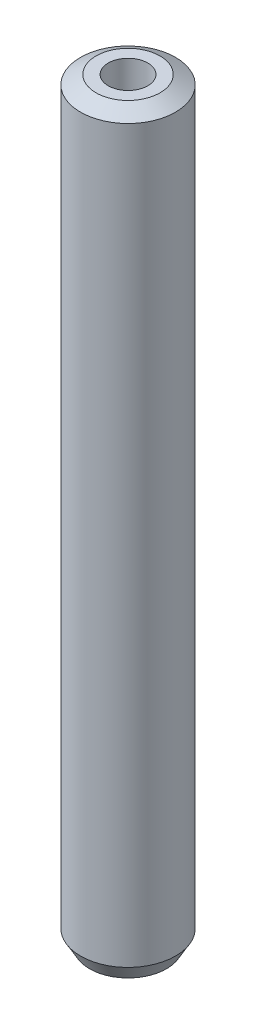
ISO-10303-21;
HEADER;
FILE_DESCRIPTION(('STEP AP214'),'2;1');
FILE_NAME('part.step','',(''),(''),'','','');
FILE_SCHEMA(('AUTOMOTIVE_DESIGN { 1 0 10303 214 1 1 1 1 }'));
ENDSEC;
DATA;
#1=APPLICATION_CONTEXT('core data for automotive mechanical design processes');
#2=APPLICATION_PROTOCOL_DEFINITION('international standard','automotive_design',2000,#1);
#3=PRODUCT_CONTEXT('',#1,'mechanical');
#4=PRODUCT('Part','Part','',(#3));
#5=PRODUCT_RELATED_PRODUCT_CATEGORY('part','',(#4));
#6=PRODUCT_DEFINITION_FORMATION('','',#4);
#7=PRODUCT_DEFINITION_CONTEXT('part definition',#1,'design');
#8=PRODUCT_DEFINITION('design','',#6,#7);
#9=PRODUCT_DEFINITION_SHAPE('','',#8);
#10=(LENGTH_UNIT() NAMED_UNIT(*) SI_UNIT(.MILLI.,.METRE.));
#11=(NAMED_UNIT(*) PLANE_ANGLE_UNIT() SI_UNIT($,.RADIAN.));
#12=(NAMED_UNIT(*) SI_UNIT($,.STERADIAN.) SOLID_ANGLE_UNIT());
#13=UNCERTAINTY_MEASURE_WITH_UNIT(LENGTH_MEASURE(1.E-05),#10,'distance_accuracy_value','');
#14=(GEOMETRIC_REPRESENTATION_CONTEXT(3) GLOBAL_UNCERTAINTY_ASSIGNED_CONTEXT((#13)) GLOBAL_UNIT_ASSIGNED_CONTEXT((#10,
#11,#12)) REPRESENTATION_CONTEXT('',''));
#15=CARTESIAN_POINT('',(0.,0.,0.));
#16=DIRECTION('',(0.,0.,1.));
#17=DIRECTION('',(1.,0.,0.));
#18=AXIS2_PLACEMENT_3D('',#15,#16,#17);
#19=CARTESIAN_POINT('',(0.,238.493673997719,0.));
#20=DIRECTION('',(0.,-1.,0.));
#21=DIRECTION('',(0.,0.,-1.));
#22=AXIS2_PLACEMENT_3D('',#19,#20,#21);
#23=CYLINDRICAL_SURFACE('',#22,15.);
#24=CARTESIAN_POINT('',(0.,235.66196893706,0.));
#25=DIRECTION('',(0.,1.,0.));
#26=DIRECTION('',(0.,0.,1.));
#27=AXIS2_PLACEMENT_3D('',#24,#25,#26);
#28=CIRCLE('',#27,15.);
#29=CARTESIAN_POINT('',(0.,235.66196893706,-15.));
#30=VERTEX_POINT('',#29);
#31=EDGE_CURVE('E50',#30,#30,#28,.F.);
#32=CARTESIAN_POINT('',(0.,4.90465703711229,0.));
#33=DIRECTION('',(0.,1.,0.));
#34=DIRECTION('',(0.,0.,1.));
#35=AXIS2_PLACEMENT_3D('',#32,#33,#34);
#36=CIRCLE('',#35,15.);
#37=CARTESIAN_POINT('',(0.,4.90465703711226,-15.));
#38=VERTEX_POINT('',#37);
#39=EDGE_CURVE('E51',#38,#38,#36,.T.);
#40=CARTESIAN_POINT('',(0.,235.66196893706,-15.));
#41=CARTESIAN_POINT('',(0.,233.258246938102,-15.));
#42=CARTESIAN_POINT('',(0.,230.854524939144,-15.));
#43=CARTESIAN_POINT('',(0.,226.047080941229,-15.));
#44=CARTESIAN_POINT('',(0.,223.643358942271,-15.));
#45=CARTESIAN_POINT('',(0.,218.835914944355,-15.));
#46=CARTESIAN_POINT('',(0.,216.432192945397,-15.));
#47=CARTESIAN_POINT('',(0.,211.624748947482,-15.));
#48=CARTESIAN_POINT('',(0.,209.221026948524,-15.));
#49=CARTESIAN_POINT('',(0.,204.413582950609,-15.));
#50=CARTESIAN_POINT('',(0.,202.009860951651,-15.));
#51=CARTESIAN_POINT('',(0.,197.202416953735,-15.));
#52=CARTESIAN_POINT('',(0.,194.798694954777,-15.));
#53=CARTESIAN_POINT('',(0.,189.991250956862,-15.));
#54=CARTESIAN_POINT('',(0.,187.587528957904,-15.));
#55=CARTESIAN_POINT('',(0.,182.780084959988,-15.));
#56=CARTESIAN_POINT('',(0.,180.376362961031,-15.));
#57=CARTESIAN_POINT('',(0.,175.568918963115,-15.));
#58=CARTESIAN_POINT('',(0.,173.165196964157,-15.));
#59=CARTESIAN_POINT('',(0.,168.357752966242,-15.));
#60=CARTESIAN_POINT('',(0.,165.954030967284,-15.));
#61=CARTESIAN_POINT('',(0.,161.146586969368,-15.));
#62=CARTESIAN_POINT('',(0.,158.742864970411,-15.));
#63=CARTESIAN_POINT('',(0.,153.935420972495,-15.));
#64=CARTESIAN_POINT('',(0.,151.531698973537,-15.));
#65=CARTESIAN_POINT('',(0.,146.724254975622,-15.));
#66=CARTESIAN_POINT('',(0.,144.320532976664,-15.));
#67=CARTESIAN_POINT('',(0.,139.513088978748,-15.));
#68=CARTESIAN_POINT('',(0.,137.109366979791,-15.));
#69=CARTESIAN_POINT('',(0.,132.301922981875,-15.));
#70=CARTESIAN_POINT('',(0.,129.898200982917,-15.));
#71=CARTESIAN_POINT('',(0.,125.090756985002,-15.));
#72=CARTESIAN_POINT('',(0.,122.687034986044,-15.));
#73=CARTESIAN_POINT('',(0.,117.879590988128,-15.));
#74=CARTESIAN_POINT('',(0.,115.47586898917,-15.));
#75=CARTESIAN_POINT('',(0.,110.668424991255,-15.));
#76=CARTESIAN_POINT('',(0.,108.264702992297,-15.));
#77=CARTESIAN_POINT('',(0.,103.457258994382,-15.));
#78=CARTESIAN_POINT('',(0.,101.053536995424,-15.));
#79=CARTESIAN_POINT('',(0.,96.2460929975082,-15.));
#80=CARTESIAN_POINT('',(0.,93.8423709985504,-15.));
#81=CARTESIAN_POINT('',(0.,89.0349270006348,-15.));
#82=CARTESIAN_POINT('',(0.,86.631205001677,-15.));
#83=CARTESIAN_POINT('',(0.,81.8237610037614,-15.));
#84=CARTESIAN_POINT('',(0.,79.4200390048036,-15.));
#85=CARTESIAN_POINT('',(0.,74.6125950068881,-15.));
#86=CARTESIAN_POINT('',(0.,72.2088730079303,-15.));
#87=CARTESIAN_POINT('',(0.,67.4014290100147,-15.));
#88=CARTESIAN_POINT('',(0.,64.9977070110569,-15.));
#89=CARTESIAN_POINT('',(0.,60.1902630131414,-15.));
#90=CARTESIAN_POINT('',(0.,57.7865410141836,-15.));
#91=CARTESIAN_POINT('',(0.,52.979097016268,-15.));
#92=CARTESIAN_POINT('',(0.,50.5753750173102,-15.));
#93=CARTESIAN_POINT('',(0.,45.7679310193946,-15.));
#94=CARTESIAN_POINT('',(0.,43.3642090204369,-15.));
#95=CARTESIAN_POINT('',(0.,38.5567650225213,-15.));
#96=CARTESIAN_POINT('',(0.,36.1530430235635,-15.));
#97=CARTESIAN_POINT('',(0.,31.3455990256479,-15.));
#98=CARTESIAN_POINT('',(0.,28.9418770266901,-15.));
#99=CARTESIAN_POINT('',(0.,24.1344330287746,-15.));
#100=CARTESIAN_POINT('',(0.,21.7307110298168,-15.));
#101=CARTESIAN_POINT('',(0.,16.9232670319012,-15.));
#102=CARTESIAN_POINT('',(0.,14.5195450329434,-15.));
#103=CARTESIAN_POINT('',(0.,9.71210103502785,-15.));
#104=CARTESIAN_POINT('',(0.,7.30837903607006,-15.));
#105=CARTESIAN_POINT('',(0.,4.90465703711226,-15.));
#106=B_SPLINE_CURVE_WITH_KNOTS('',3,(#40,#41,#42,#43,#44,#45,#46,#47,#48,#49,#50,#51,#52,#53,
#54,#55,#56,#57,#58,#59,#60,#61,#62,#63,#64,#65,#66,#67,#68,#69,#70,#71,#72,#73,#74,#75,#76,#77,
#78,#79,#80,#81,#82,#83,#84,#85,#86,#87,#88,#89,#90,#91,#92,#93,#94,#95,#96,#97,#98,#99,#100,
#101,#102,#103,#104,#105),.UNSPECIFIED.,.F.,.F.,(4,2,2,2,2,2,2,2,2,2,2,2,2,2,2,2,2,2,2,2,2,2,2,
2,2,2,2,2,2,2,2,2,4),(0.,7.21116599687338,14.4223319937467,21.6334979906201,28.8446639874934,
36.0558299843668,43.2669959812402,50.4781619781135,57.6893279749869,64.9004939718602,
72.1116599687336,79.322825965607,86.5339919624803,93.7451579593537,100.956323956227,
108.1674899531,115.378655949974,122.589821946847,129.80098794372,137.012153940594,
144.223319937467,151.434485934341,158.645651931214,165.856817928087,173.067983924961,
180.279149921834,187.490315918707,194.701481915581,201.912647912454,209.123813909327,
216.334979906201,223.546145903074,230.757311899948),.UNSPECIFIED.);
#107=EDGE_CURVE('BSEAM39',#30,#38,#106,.T.);
#108=ORIENTED_EDGE('',*,*,#31,.T.);
#109=ORIENTED_EDGE('',*,*,#39,.T.);
#110=ORIENTED_EDGE('',*,*,#107,.T.);
#111=ORIENTED_EDGE('',*,*,#107,.F.);
#112=EDGE_LOOP('',(#108,#110,#109,#111));
#113=FACE_BOUND('',#112,.T.);
#114=ADVANCED_FACE('F39',(#113),#23,.T.);
#115=CARTESIAN_POINT('',(0.,238.493673997719,0.));
#116=DIRECTION('',(0.,1.,0.));
#117=DIRECTION('',(0.,0.,1.));
#118=AXIS2_PLACEMENT_3D('',#115,#116,#117);
#119=PLANE('',#118);
#120=CARTESIAN_POINT('',(0.,238.493673997719,0.));
#121=DIRECTION('',(0.,1.,0.));
#122=DIRECTION('',(0.,0.,1.));
#123=AXIS2_PLACEMENT_3D('',#120,#121,#122);
#124=CIRCLE('',#123,10.0953429628881);
#125=CARTESIAN_POINT('',(0.,238.493673997719,-10.0953429628881));
#126=VERTEX_POINT('',#125);
#127=EDGE_CURVE('E54',#126,#126,#124,.T.);
#128=ORIENTED_EDGE('',*,*,#127,.T.);
#129=EDGE_LOOP('',(#128));
#130=FACE_BOUND('',#129,.T.);
#131=CARTESIAN_POINT('',(0.,238.493673997719,0.));
#132=DIRECTION('',(0.,1.,0.));
#133=DIRECTION('',(0.,0.,1.));
#134=AXIS2_PLACEMENT_3D('',#131,#132,#133);
#135=CIRCLE('',#134,6.24374749063634);
#136=CARTESIAN_POINT('',(0.,238.493673997719,-6.24374749063634));
#137=VERTEX_POINT('',#136);
#138=EDGE_CURVE('E58',#137,#137,#135,.T.);
#139=ORIENTED_EDGE('',*,*,#138,.F.);
#140=EDGE_LOOP('',(#139));
#141=FACE_BOUND('',#140,.T.);
#142=ADVANCED_FACE('F69',(#130,#141),#119,.T.);
#143=CARTESIAN_POINT('',(0.,0.,0.));
#144=DIRECTION('',(0.,1.,0.));
#145=DIRECTION('',(0.,0.,1.));
#146=AXIS2_PLACEMENT_3D('',#143,#144,#145);
#147=PLANE('',#146);
#148=CARTESIAN_POINT('',(0.,0.,0.));
#149=DIRECTION('',(0.,1.,0.));
#150=DIRECTION('',(0.,0.,1.));
#151=AXIS2_PLACEMENT_3D('',#148,#149,#150);
#152=CIRCLE('',#151,12.1682949393404);
#153=CARTESIAN_POINT('',(0.,0.,12.1682949393404));
#154=VERTEX_POINT('',#153);
#155=EDGE_CURVE('E10',#154,#154,#152,.F.);
#156=ORIENTED_EDGE('',*,*,#155,.T.);
#157=EDGE_LOOP('',(#156));
#158=FACE_BOUND('',#157,.T.);
#159=CARTESIAN_POINT('',(0.,0.,0.));
#160=DIRECTION('',(0.,1.,0.));
#161=DIRECTION('',(0.,0.,1.));
#162=AXIS2_PLACEMENT_3D('',#159,#160,#161);
#163=CIRCLE('',#162,6.24374749063634);
#164=CARTESIAN_POINT('',(0.,0.,-6.24374749063634));
#165=VERTEX_POINT('',#164);
#166=EDGE_CURVE('E63',#165,#165,#163,.T.);
#167=ORIENTED_EDGE('',*,*,#166,.T.);
#168=EDGE_LOOP('',(#167));
#169=FACE_BOUND('',#168,.T.);
#170=ADVANCED_FACE('F75',(#158,#169),#147,.F.);
#171=CARTESIAN_POINT('',(0.,238.493673997719,0.));
#172=DIRECTION('',(0.,-1.,0.));
#173=DIRECTION('',(0.,0.,-1.));
#174=AXIS2_PLACEMENT_3D('',#171,#172,#173);
#175=CYLINDRICAL_SURFACE('',#174,6.24374749063634);
#176=CARTESIAN_POINT('',(0.,238.493673997719,-6.24374749063634));
#177=CARTESIAN_POINT('',(0.,236.009364893576,-6.24374749063634));
#178=CARTESIAN_POINT('',(0.,233.525055789433,-6.24374749063634));
#179=CARTESIAN_POINT('',(0.,228.556437581147,-6.24374749063634));
#180=CARTESIAN_POINT('',(0.,226.072128477005,-6.24374749063634));
#181=CARTESIAN_POINT('',(0.,221.103510268719,-6.24374749063634));
#182=CARTESIAN_POINT('',(0.,218.619201164576,-6.24374749063634));
#183=CARTESIAN_POINT('',(0.,213.65058295629,-6.24374749063634));
#184=CARTESIAN_POINT('',(0.,211.166273852147,-6.24374749063634));
#185=CARTESIAN_POINT('',(0.,206.197655643861,-6.24374749063634));
#186=CARTESIAN_POINT('',(0.,203.713346539718,-6.24374749063634));
#187=CARTESIAN_POINT('',(0.,198.744728331433,-6.24374749063634));
#188=CARTESIAN_POINT('',(0.,196.26041922729,-6.24374749063634));
#189=CARTESIAN_POINT('',(0.,191.291801019004,-6.24374749063634));
#190=CARTESIAN_POINT('',(0.,188.807491914861,-6.24374749063634));
#191=CARTESIAN_POINT('',(0.,183.838873706575,-6.24374749063634));
#192=CARTESIAN_POINT('',(0.,181.354564602432,-6.24374749063634));
#193=CARTESIAN_POINT('',(0.,176.385946394146,-6.24374749063634));
#194=CARTESIAN_POINT('',(0.,173.901637290004,-6.24374749063634));
#195=CARTESIAN_POINT('',(0.,168.933019081718,-6.24374749063634));
#196=CARTESIAN_POINT('',(0.,166.448709977575,-6.24374749063634));
#197=CARTESIAN_POINT('',(0.,161.480091769289,-6.24374749063634));
#198=CARTESIAN_POINT('',(0.,158.995782665146,-6.24374749063634));
#199=CARTESIAN_POINT('',(0.,154.02716445686,-6.24374749063634));
#200=CARTESIAN_POINT('',(0.,151.542855352717,-6.24374749063634));
#201=CARTESIAN_POINT('',(0.,146.574237144432,-6.24374749063634));
#202=CARTESIAN_POINT('',(0.,144.089928040289,-6.24374749063634));
#203=CARTESIAN_POINT('',(0.,139.121309832003,-6.24374749063634));
#204=CARTESIAN_POINT('',(0.,136.63700072786,-6.24374749063634));
#205=CARTESIAN_POINT('',(0.,131.668382519574,-6.24374749063634));
#206=CARTESIAN_POINT('',(0.,129.184073415431,-6.24374749063634));
#207=CARTESIAN_POINT('',(0.,124.215455207145,-6.24374749063634));
#208=CARTESIAN_POINT('',(0.,121.731146103002,-6.24374749063634));
#209=CARTESIAN_POINT('',(0.,116.762527894717,-6.24374749063634));
#210=CARTESIAN_POINT('',(0.,114.278218790574,-6.24374749063634));
#211=CARTESIAN_POINT('',(0.,109.309600582288,-6.24374749063634));
#212=CARTESIAN_POINT('',(0.,106.825291478145,-6.24374749063634));
#213=CARTESIAN_POINT('',(0.,101.856673269859,-6.24374749063634));
#214=CARTESIAN_POINT('',(0.,99.3723641657163,-6.24374749063634));
#215=CARTESIAN_POINT('',(0.,94.4037459574305,-6.24374749063634));
#216=CARTESIAN_POINT('',(0.,91.9194368532876,-6.24374749063634));
#217=CARTESIAN_POINT('',(0.,86.9508186450018,-6.24374749063634));
#218=CARTESIAN_POINT('',(0.,84.4665095408589,-6.24374749063634));
#219=CARTESIAN_POINT('',(0.,79.497891332573,-6.24374749063634));
#220=CARTESIAN_POINT('',(0.,77.0135822284301,-6.24374749063634));
#221=CARTESIAN_POINT('',(0.,72.0449640201443,-6.24374749063634));
#222=CARTESIAN_POINT('',(0.,69.5606549160014,-6.24374749063634));
#223=CARTESIAN_POINT('',(0.,64.5920367077156,-6.24374749063634));
#224=CARTESIAN_POINT('',(0.,62.1077276035727,-6.24374749063634));
#225=CARTESIAN_POINT('',(0.,57.1391093952869,-6.24374749063634));
#226=CARTESIAN_POINT('',(0.,54.6548002911439,-6.24374749063634));
#227=CARTESIAN_POINT('',(0.,49.6861820828581,-6.24374749063634));
#228=CARTESIAN_POINT('',(0.,47.2018729787152,-6.24374749063634));
#229=CARTESIAN_POINT('',(0.,42.2332547704294,-6.24374749063634));
#230=CARTESIAN_POINT('',(0.,39.7489456662865,-6.24374749063634));
#231=CARTESIAN_POINT('',(0.,34.7803274580007,-6.24374749063634));
#232=CARTESIAN_POINT('',(0.,32.2960183538578,-6.24374749063634));
#233=CARTESIAN_POINT('',(0.,27.327400145572,-6.24374749063634));
#234=CARTESIAN_POINT('',(0.,24.8430910414291,-6.24374749063634));
#235=CARTESIAN_POINT('',(0.,19.8744728331432,-6.24374749063634));
#236=CARTESIAN_POINT('',(0.,17.3901637290003,-6.24374749063634));
#237=CARTESIAN_POINT('',(0.,12.4215455207145,-6.24374749063634));
#238=CARTESIAN_POINT('',(0.,9.9372364165716,-6.24374749063634));
#239=CARTESIAN_POINT('',(0.,4.96861820828579,-6.24374749063634));
#240=CARTESIAN_POINT('',(0.,2.48430910414288,-6.24374749063634));
#241=CARTESIAN_POINT('',(0.,0.,-6.24374749063634));
#242=B_SPLINE_CURVE_WITH_KNOTS('',3,(#176,#177,#178,#179,#180,#181,#182,#183,#184,#185,#186,
#187,#188,#189,#190,#191,#192,#193,#194,#195,#196,#197,#198,#199,#200,#201,#202,#203,#204,#205,
#206,#207,#208,#209,#210,#211,#212,#213,#214,#215,#216,#217,#218,#219,#220,#221,#222,#223,#224,
#225,#226,#227,#228,#229,#230,#231,#232,#233,#234,#235,#236,#237,#238,#239,#240,#241),
.UNSPECIFIED.,.F.,.F.,(4,2,2,2,2,2,2,2,2,2,2,2,2,2,2,2,2,2,2,2,2,2,2,2,2,2,2,2,2,2,2,2,4),(0.,
7.45292731242875,14.9058546248575,22.3587819372862,29.8117092497149,37.2646365621436,
44.7175638745723,52.1704911870011,59.6234184994298,67.0763458118585,74.5292731242873,
81.982200436716,89.4351277491447,96.8880550615734,104.340982374002,111.793909686431,
119.24683699886,126.699764311288,134.152691623717,141.605618936146,149.058546248574,
156.511473561003,163.964400873432,171.417328185861,178.870255498289,186.323182810718,
193.776110123147,201.229037435576,208.681964748004,216.134892060433,223.587819372862,
231.04074668529,238.493673997719),.UNSPECIFIED.);
#243=EDGE_CURVE('BSEAM70',#137,#165,#242,.T.);
#244=ORIENTED_EDGE('',*,*,#138,.T.);
#245=ORIENTED_EDGE('',*,*,#166,.F.);
#246=ORIENTED_EDGE('',*,*,#243,.T.);
#247=ORIENTED_EDGE('',*,*,#243,.F.);
#248=EDGE_LOOP('',(#244,#246,#245,#247));
#249=FACE_BOUND('',#248,.T.);
#250=ADVANCED_FACE('F70',(#249),#175,.F.);
#251=CARTESIAN_POINT('',(0.,238.493673997719,0.));
#252=DIRECTION('',(0.,-1.,0.));
#253=DIRECTION('',(0.,0.,-1.));
#254=AXIS2_PLACEMENT_3D('',#251,#252,#253);
#255=CONICAL_SURFACE('',#254,10.0953429628881,1.0471975511966);
#256=CARTESIAN_POINT('',(0.,235.66196893706,-15.));
#257=CARTESIAN_POINT('',(0.,235.691465864775,-14.9489098225301));
#258=CARTESIAN_POINT('',(0.,235.72096279249,-14.8978196450602));
#259=CARTESIAN_POINT('',(0.,235.779956647921,-14.7956392901204));
#260=CARTESIAN_POINT('',(0.,235.809453575636,-14.7445491126504));
#261=CARTESIAN_POINT('',(0.,235.868447431066,-14.6423687577106));
#262=CARTESIAN_POINT('',(0.,235.897944358781,-14.5912785802407));
#263=CARTESIAN_POINT('',(0.,235.956938214212,-14.4890982253009));
#264=CARTESIAN_POINT('',(0.,235.986435141927,-14.438008047831));
#265=CARTESIAN_POINT('',(0.,236.045428997357,-14.3358276928911));
#266=CARTESIAN_POINT('',(0.,236.074925925073,-14.2847375154212));
#267=CARTESIAN_POINT('',(0.,236.133919780503,-14.1825571604814));
#268=CARTESIAN_POINT('',(0.,236.163416708218,-14.1314669830115));
#269=CARTESIAN_POINT('',(0.,236.222410563649,-14.0292866280716));
#270=CARTESIAN_POINT('',(0.,236.251907491364,-13.9781964506017));
#271=CARTESIAN_POINT('',(0.,236.310901346794,-13.8760160956619));
#272=CARTESIAN_POINT('',(0.,236.340398274509,-13.824925918192));
#273=CARTESIAN_POINT('',(0.,236.39939212994,-13.7227455632521));
#274=CARTESIAN_POINT('',(0.,236.428889057655,-13.6716553857822));
#275=CARTESIAN_POINT('',(0.,236.487882913085,-13.5694750308424));
#276=CARTESIAN_POINT('',(0.,236.517379840801,-13.5183848533725));
#277=CARTESIAN_POINT('',(0.,236.576373696231,-13.4162044984326));
#278=CARTESIAN_POINT('',(0.,236.605870623946,-13.3651143209627));
#279=CARTESIAN_POINT('',(0.,236.664864479377,-13.2629339660229));
#280=CARTESIAN_POINT('',(0.,236.694361407092,-13.211843788553));
#281=CARTESIAN_POINT('',(0.,236.753355262522,-13.1096634336131));
#282=CARTESIAN_POINT('',(0.,236.782852190237,-13.0585732561432));
#283=CARTESIAN_POINT('',(0.,236.841846045668,-12.9563929012034));
#284=CARTESIAN_POINT('',(0.,236.871342973383,-12.9053027237335));
#285=CARTESIAN_POINT('',(0.,236.930336828813,-12.8031223687937));
#286=CARTESIAN_POINT('',(0.,236.959833756529,-12.7520321913237));
#287=CARTESIAN_POINT('',(0.,237.018827611959,-12.6498518363839));
#288=CARTESIAN_POINT('',(0.,237.048324539674,-12.598761658914));
#289=CARTESIAN_POINT('',(0.,237.107318395105,-12.4965813039742));
#290=CARTESIAN_POINT('',(0.,237.13681532282,-12.4454911265042));
#291=CARTESIAN_POINT('',(0.,237.19580917825,-12.3433107715644));
#292=CARTESIAN_POINT('',(0.,237.225306105965,-12.2922205940945));
#293=CARTESIAN_POINT('',(0.,237.284299961396,-12.1900402391547));
#294=CARTESIAN_POINT('',(0.,237.313796889111,-12.1389500616848));
#295=CARTESIAN_POINT('',(0.,237.372790744541,-12.0367697067449));
#296=CARTESIAN_POINT('',(0.,237.402287672257,-11.985679529275));
#297=CARTESIAN_POINT('',(0.,237.461281527687,-11.8834991743352));
#298=CARTESIAN_POINT('',(0.,237.490778455402,-11.8324089968653));
#299=CARTESIAN_POINT('',(0.,237.549772310833,-11.7302286419254));
#300=CARTESIAN_POINT('',(0.,237.579269238548,-11.6791384644555));
#301=CARTESIAN_POINT('',(0.,237.638263093978,-11.5769581095157));
#302=CARTESIAN_POINT('',(0.,237.667760021693,-11.5258679320458));
#303=CARTESIAN_POINT('',(0.,237.726753877124,-11.4236875771059));
#304=CARTESIAN_POINT('',(0.,237.756250804839,-11.372597399636));
#305=CARTESIAN_POINT('',(0.,237.815244660269,-11.2704170446962));
#306=CARTESIAN_POINT('',(0.,237.844741587985,-11.2193268672263));
#307=CARTESIAN_POINT('',(0.,237.903735443415,-11.1171465122864));
#308=CARTESIAN_POINT('',(0.,237.93323237113,-11.0660563348165));
#309=CARTESIAN_POINT('',(0.,237.992226226561,-10.9638759798767));
#310=CARTESIAN_POINT('',(0.,238.021723154276,-10.9127858024068));
#311=CARTESIAN_POINT('',(0.,238.080717009706,-10.8106054474669));
#312=CARTESIAN_POINT('',(0.,238.110213937422,-10.759515269997));
#313=CARTESIAN_POINT('',(0.,238.169207792852,-10.6573349150572));
#314=CARTESIAN_POINT('',(0.,238.198704720567,-10.6062447375873));
#315=CARTESIAN_POINT('',(0.,238.257698575998,-10.5040643826475));
#316=CARTESIAN_POINT('',(0.,238.287195503713,-10.4529742051775));
#317=CARTESIAN_POINT('',(0.,238.346189359143,-10.3507938502377));
#318=CARTESIAN_POINT('',(0.,238.375686286858,-10.2997036727678));
#319=CARTESIAN_POINT('',(0.,238.434680142289,-10.197523317828));
#320=CARTESIAN_POINT('',(0.,238.464177070004,-10.146433140358));
#321=CARTESIAN_POINT('',(0.,238.493673997719,-10.0953429628881));
#322=B_SPLINE_CURVE_WITH_KNOTS('',3,(#256,#257,#258,#259,#260,#261,#262,#263,#264,#265,#266,
#267,#268,#269,#270,#271,#272,#273,#274,#275,#276,#277,#278,#279,#280,#281,#282,#283,#284,#285,
#286,#287,#288,#289,#290,#291,#292,#293,#294,#295,#296,#297,#298,#299,#300,#301,#302,#303,#304,
#305,#306,#307,#308,#309,#310,#311,#312,#313,#314,#315,#316,#317,#318,#319,#320,#321),
.UNSPECIFIED.,.F.,.F.,(4,2,2,2,2,2,2,2,2,2,2,2,2,2,2,2,2,2,2,2,2,2,2,2,2,2,2,2,2,2,2,2,4),(0.,
0.176981566291207,0.353963132582415,0.53094469887362,0.707926265164829,0.884907831456035,
1.06188939774724,1.23887096403846,1.41585253032967,1.59283409662088,1.76981566291208,
1.94679722920329,2.1237787954945,2.30076036178572,2.47774192807693,2.65472349436813,
2.83170506065934,3.00868662695055,3.18566819324175,3.36264975953296,3.53963132582418,
3.71661289211539,3.89359445840659,4.0705760246978,4.24755759098901,4.42453915728022,
4.60152072357144,4.77850228986264,4.95548385615385,5.13246542244506,5.30944698873626,
5.48642855502747,5.66341012131869),.UNSPECIFIED.);
#323=EDGE_CURVE('BSEAM81',#30,#126,#322,.T.);
#324=ORIENTED_EDGE('',*,*,#31,.F.);
#325=ORIENTED_EDGE('',*,*,#127,.F.);
#326=ORIENTED_EDGE('',*,*,#323,.T.);
#327=ORIENTED_EDGE('',*,*,#323,.F.);
#328=EDGE_LOOP('',(#324,#326,#325,#327));
#329=FACE_BOUND('',#328,.T.);
#330=ADVANCED_FACE('F81',(#329),#255,.T.);
#331=CARTESIAN_POINT('',(0.,4.90465703711229,0.));
#332=DIRECTION('',(0.,1.,0.));
#333=DIRECTION('',(0.,0.,1.));
#334=AXIS2_PLACEMENT_3D('',#331,#332,#333);
#335=CONICAL_SURFACE('',#334,15.,0.523598775598302);
#336=ORIENTED_EDGE('',*,*,#155,.F.);
#337=EDGE_LOOP('',(#336));
#338=FACE_BOUND('',#337,.T.);
#339=ORIENTED_EDGE('',*,*,#39,.F.);
#340=EDGE_LOOP('',(#339));
#341=FACE_BOUND('',#340,.T.);
#342=ADVANCED_FACE('F45',(#338,#341),#335,.T.);
#343=CLOSED_SHELL('',(#114,#142,#170,#250,#330,#342));
#344=MANIFOLD_SOLID_BREP('B2',#343);
#345=ADVANCED_BREP_SHAPE_REPRESENTATION('',(#18,#344),#14);
#346=SHAPE_DEFINITION_REPRESENTATION(#9,#345);
ENDSEC;
END-ISO-10303-21;
